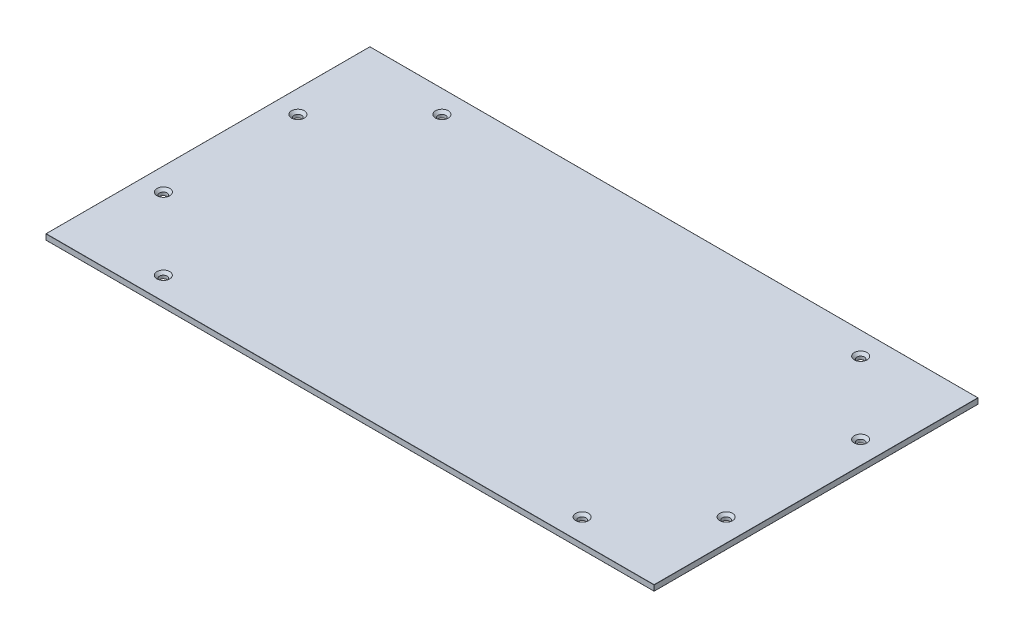
ISO-10303-21;
HEADER;
FILE_DESCRIPTION(('STEP AP214'),'2;1');
FILE_NAME('part.step','',(''),(''),'','','');
FILE_SCHEMA(('AUTOMOTIVE_DESIGN { 1 0 10303 214 1 1 1 1 }'));
ENDSEC;
DATA;
#1=APPLICATION_CONTEXT('core data for automotive mechanical design processes');
#2=APPLICATION_PROTOCOL_DEFINITION('international standard','automotive_design',2000,#1);
#3=PRODUCT_CONTEXT('',#1,'mechanical');
#4=PRODUCT('Part','Part','',(#3));
#5=PRODUCT_RELATED_PRODUCT_CATEGORY('part','',(#4));
#6=PRODUCT_DEFINITION_FORMATION('','',#4);
#7=PRODUCT_DEFINITION_CONTEXT('part definition',#1,'design');
#8=PRODUCT_DEFINITION('design','',#6,#7);
#9=PRODUCT_DEFINITION_SHAPE('','',#8);
#10=(LENGTH_UNIT() NAMED_UNIT(*) SI_UNIT(.MILLI.,.METRE.));
#11=(NAMED_UNIT(*) PLANE_ANGLE_UNIT() SI_UNIT($,.RADIAN.));
#12=(NAMED_UNIT(*) SI_UNIT($,.STERADIAN.) SOLID_ANGLE_UNIT());
#13=UNCERTAINTY_MEASURE_WITH_UNIT(LENGTH_MEASURE(1.E-05),#10,'distance_accuracy_value','');
#14=(GEOMETRIC_REPRESENTATION_CONTEXT(3) GLOBAL_UNCERTAINTY_ASSIGNED_CONTEXT((#13)) GLOBAL_UNIT_ASSIGNED_CONTEXT((#10,
#11,#12)) REPRESENTATION_CONTEXT('',''));
#15=CARTESIAN_POINT('',(0.,0.,0.));
#16=DIRECTION('',(0.,0.,1.));
#17=DIRECTION('',(1.,0.,0.));
#18=AXIS2_PLACEMENT_3D('',#15,#16,#17);
#19=CARTESIAN_POINT('',(321.,6.,-171.));
#20=DIRECTION('',(-1.,0.,0.));
#21=DIRECTION('',(0.,0.,1.));
#22=AXIS2_PLACEMENT_3D('',#19,#20,#21);
#23=PLANE('',#22);
#24=DIRECTION('',(0.,0.,-1.));
#25=VECTOR('',#24,1.);
#26=CARTESIAN_POINT('',(321.,0.2,-171.));
#27=LINE('',#26,#25);
#28=CARTESIAN_POINT('',(321.,0.2,170.8));
#29=VERTEX_POINT('',#28);
#30=CARTESIAN_POINT('',(321.,0.2,-170.8));
#31=VERTEX_POINT('',#30);
#32=EDGE_CURVE('E285',#29,#31,#27,.T.);
#33=ORIENTED_EDGE('',*,*,#32,.T.);
#34=DIRECTION('',(0.,-1.,0.));
#35=VECTOR('',#34,1.);
#36=CARTESIAN_POINT('',(321.,6.,-170.8));
#37=LINE('',#36,#35);
#38=CARTESIAN_POINT('',(321.,5.8,-170.8));
#39=VERTEX_POINT('',#38);
#40=EDGE_CURVE('E287',#31,#39,#37,.F.);
#41=ORIENTED_EDGE('',*,*,#40,.T.);
#42=DIRECTION('',(0.,0.,-1.));
#43=VECTOR('',#42,1.);
#44=CARTESIAN_POINT('',(321.,5.8,171.));
#45=LINE('',#44,#43);
#46=CARTESIAN_POINT('',(321.,5.8,170.8));
#47=VERTEX_POINT('',#46);
#48=EDGE_CURVE('E283',#39,#47,#45,.F.);
#49=ORIENTED_EDGE('',*,*,#48,.T.);
#50=DIRECTION('',(0.,-1.,0.));
#51=VECTOR('',#50,1.);
#52=CARTESIAN_POINT('',(321.,6.,170.8));
#53=LINE('',#52,#51);
#54=EDGE_CURVE('E281',#47,#29,#53,.T.);
#55=ORIENTED_EDGE('',*,*,#54,.T.);
#56=EDGE_LOOP('',(#33,#41,#49,#55));
#57=FACE_BOUND('',#56,.T.);
#58=ADVANCED_FACE('F32',(#57),#23,.F.);
#59=CARTESIAN_POINT('',(-321.,6.,-171.));
#60=DIRECTION('',(0.,0.,1.));
#61=DIRECTION('',(1.,0.,0.));
#62=AXIS2_PLACEMENT_3D('',#59,#60,#61);
#63=PLANE('',#62);
#64=DIRECTION('',(-1.,0.,0.));
#65=VECTOR('',#64,1.);
#66=CARTESIAN_POINT('',(321.,5.8,-171.));
#67=LINE('',#66,#65);
#68=CARTESIAN_POINT('',(-320.8,5.8,-171.));
#69=VERTEX_POINT('',#68);
#70=CARTESIAN_POINT('',(320.8,5.8,-171.));
#71=VERTEX_POINT('',#70);
#72=EDGE_CURVE('E131',#69,#71,#67,.F.);
#73=ORIENTED_EDGE('',*,*,#72,.T.);
#74=DIRECTION('',(0.,-1.,0.));
#75=VECTOR('',#74,1.);
#76=CARTESIAN_POINT('',(320.8,6.,-171.));
#77=LINE('',#76,#75);
#78=CARTESIAN_POINT('',(320.8,0.2,-171.));
#79=VERTEX_POINT('',#78);
#80=EDGE_CURVE('E127',#71,#79,#77,.T.);
#81=ORIENTED_EDGE('',*,*,#80,.T.);
#82=DIRECTION('',(-1.,0.,0.));
#83=VECTOR('',#82,1.);
#84=CARTESIAN_POINT('',(-321.,0.2,-171.));
#85=LINE('',#84,#83);
#86=CARTESIAN_POINT('',(-320.8,0.2,-171.));
#87=VERTEX_POINT('',#86);
#88=EDGE_CURVE('E121',#79,#87,#85,.T.);
#89=ORIENTED_EDGE('',*,*,#88,.T.);
#90=DIRECTION('',(0.,-1.,0.));
#91=VECTOR('',#90,1.);
#92=CARTESIAN_POINT('',(-320.8,6.,-171.));
#93=LINE('',#92,#91);
#94=EDGE_CURVE('E124',#87,#69,#93,.F.);
#95=ORIENTED_EDGE('',*,*,#94,.T.);
#96=EDGE_LOOP('',(#73,#81,#89,#95));
#97=FACE_BOUND('',#96,.T.);
#98=ADVANCED_FACE('F123',(#97),#63,.F.);
#99=CARTESIAN_POINT('',(-321.,6.,-171.));
#100=DIRECTION('',(1.,0.,0.));
#101=DIRECTION('',(0.,0.,-1.));
#102=AXIS2_PLACEMENT_3D('',#99,#100,#101);
#103=PLANE('',#102);
#104=DIRECTION('',(0.,0.,1.));
#105=VECTOR('',#104,1.);
#106=CARTESIAN_POINT('',(-321.,5.8,-171.));
#107=LINE('',#106,#105);
#108=CARTESIAN_POINT('',(-321.,5.8,170.8));
#109=VERTEX_POINT('',#108);
#110=CARTESIAN_POINT('',(-321.,5.8,-170.8));
#111=VERTEX_POINT('',#110);
#112=EDGE_CURVE('E308',#109,#111,#107,.F.);
#113=ORIENTED_EDGE('',*,*,#112,.T.);
#114=DIRECTION('',(0.,-1.,0.));
#115=VECTOR('',#114,1.);
#116=CARTESIAN_POINT('',(-321.,6.,-170.8));
#117=LINE('',#116,#115);
#118=CARTESIAN_POINT('',(-321.,0.2,-170.8));
#119=VERTEX_POINT('',#118);
#120=EDGE_CURVE('E312',#111,#119,#117,.T.);
#121=ORIENTED_EDGE('',*,*,#120,.T.);
#122=DIRECTION('',(0.,0.,1.));
#123=VECTOR('',#122,1.);
#124=CARTESIAN_POINT('',(-321.,0.2,-171.));
#125=LINE('',#124,#123);
#126=CARTESIAN_POINT('',(-321.,0.2,170.8));
#127=VERTEX_POINT('',#126);
#128=EDGE_CURVE('E310',#119,#127,#125,.T.);
#129=ORIENTED_EDGE('',*,*,#128,.T.);
#130=DIRECTION('',(0.,-1.,0.));
#131=VECTOR('',#130,1.);
#132=CARTESIAN_POINT('',(-321.,6.,170.8));
#133=LINE('',#132,#131);
#134=EDGE_CURVE('E306',#127,#109,#133,.F.);
#135=ORIENTED_EDGE('',*,*,#134,.T.);
#136=EDGE_LOOP('',(#113,#121,#129,#135));
#137=FACE_BOUND('',#136,.T.);
#138=ADVANCED_FACE('F363',(#137),#103,.F.);
#139=CARTESIAN_POINT('',(-321.,6.,171.));
#140=DIRECTION('',(0.,0.,-1.));
#141=DIRECTION('',(-1.,0.,0.));
#142=AXIS2_PLACEMENT_3D('',#139,#140,#141);
#143=PLANE('',#142);
#144=DIRECTION('',(0.,-1.,0.));
#145=VECTOR('',#144,1.);
#146=CARTESIAN_POINT('',(-320.8,6.,171.));
#147=LINE('',#146,#145);
#148=CARTESIAN_POINT('',(-320.8,5.8,171.));
#149=VERTEX_POINT('',#148);
#150=CARTESIAN_POINT('',(-320.8,0.2,171.));
#151=VERTEX_POINT('',#150);
#152=EDGE_CURVE('E52',#149,#151,#147,.T.);
#153=ORIENTED_EDGE('',*,*,#152,.T.);
#154=DIRECTION('',(1.,0.,0.));
#155=VECTOR('',#154,1.);
#156=CARTESIAN_POINT('',(-321.,0.2,171.));
#157=LINE('',#156,#155);
#158=CARTESIAN_POINT('',(320.8,0.2,171.));
#159=VERTEX_POINT('',#158);
#160=EDGE_CURVE('E11',#151,#159,#157,.T.);
#161=ORIENTED_EDGE('',*,*,#160,.T.);
#162=DIRECTION('',(0.,-1.,0.));
#163=VECTOR('',#162,1.);
#164=CARTESIAN_POINT('',(320.8,6.,171.));
#165=LINE('',#164,#163);
#166=CARTESIAN_POINT('',(320.8,5.8,171.));
#167=VERTEX_POINT('',#166);
#168=EDGE_CURVE('E41',#159,#167,#165,.F.);
#169=ORIENTED_EDGE('',*,*,#168,.T.);
#170=DIRECTION('',(1.,0.,0.));
#171=VECTOR('',#170,1.);
#172=CARTESIAN_POINT('',(-321.,5.8,171.));
#173=LINE('',#172,#171);
#174=EDGE_CURVE('E315',#167,#149,#173,.F.);
#175=ORIENTED_EDGE('',*,*,#174,.T.);
#176=EDGE_LOOP('',(#153,#161,#169,#175));
#177=FACE_BOUND('',#176,.T.);
#178=ADVANCED_FACE('F717',(#177),#143,.F.);
#179=CARTESIAN_POINT('',(0.,6.,0.));
#180=DIRECTION('',(0.,1.,0.));
#181=DIRECTION('',(0.,0.,1.));
#182=AXIS2_PLACEMENT_3D('',#179,#180,#181);
#183=PLANE('',#182);
#184=DIRECTION('',(0.,0.,-1.));
#185=VECTOR('',#184,1.);
#186=CARTESIAN_POINT('',(320.8,6.,-171.));
#187=LINE('',#186,#185);
#188=CARTESIAN_POINT('',(320.8,6.,170.8));
#189=VERTEX_POINT('',#188);
#190=CARTESIAN_POINT('',(320.8,6.,-170.8));
#191=VERTEX_POINT('',#190);
#192=EDGE_CURVE('E301',#189,#191,#187,.T.);
#193=ORIENTED_EDGE('',*,*,#192,.T.);
#194=DIRECTION('',(-1.,0.,0.));
#195=VECTOR('',#194,1.);
#196=CARTESIAN_POINT('',(-321.,6.,-170.8));
#197=LINE('',#196,#195);
#198=CARTESIAN_POINT('',(-320.8,6.,-170.8));
#199=VERTEX_POINT('',#198);
#200=EDGE_CURVE('E303',#191,#199,#197,.T.);
#201=ORIENTED_EDGE('',*,*,#200,.T.);
#202=DIRECTION('',(0.,0.,1.));
#203=VECTOR('',#202,1.);
#204=CARTESIAN_POINT('',(-320.8,6.,171.));
#205=LINE('',#204,#203);
#206=CARTESIAN_POINT('',(-320.8,6.,170.8));
#207=VERTEX_POINT('',#206);
#208=EDGE_CURVE('E299',#199,#207,#205,.T.);
#209=ORIENTED_EDGE('',*,*,#208,.T.);
#210=DIRECTION('',(1.,0.,0.));
#211=VECTOR('',#210,1.);
#212=CARTESIAN_POINT('',(321.,6.,170.8));
#213=LINE('',#212,#211);
#214=EDGE_CURVE('E297',#207,#189,#213,.T.);
#215=ORIENTED_EDGE('',*,*,#214,.T.);
#216=EDGE_LOOP('',(#193,#201,#209,#215));
#217=FACE_BOUND('',#216,.T.);
#218=CARTESIAN_POINT('',(-297.,6.,-71.));
#219=DIRECTION('',(0.,1.,0.));
#220=DIRECTION('',(0.,0.,1.));
#221=AXIS2_PLACEMENT_3D('',#218,#219,#220);
#222=CIRCLE('',#221,6.75000000000003);
#223=CARTESIAN_POINT('',(-297.,6.,-64.2499999999999));
#224=VERTEX_POINT('',#223);
#225=EDGE_CURVE('E256',#224,#224,#222,.F.);
#226=ORIENTED_EDGE('',*,*,#225,.T.);
#227=EDGE_LOOP('',(#226));
#228=FACE_BOUND('',#227,.T.);
#229=CARTESIAN_POINT('',(-221.,6.,-147.));
#230=DIRECTION('',(0.,1.,0.));
#231=DIRECTION('',(0.,0.,1.));
#232=AXIS2_PLACEMENT_3D('',#229,#230,#231);
#233=CIRCLE('',#232,6.75000000000003);
#234=CARTESIAN_POINT('',(-221.,6.,-140.25));
#235=VERTEX_POINT('',#234);
#236=EDGE_CURVE('E253',#235,#235,#233,.F.);
#237=ORIENTED_EDGE('',*,*,#236,.T.);
#238=EDGE_LOOP('',(#237));
#239=FACE_BOUND('',#238,.T.);
#240=CARTESIAN_POINT('',(221.,6.,-147.));
#241=DIRECTION('',(0.,1.,0.));
#242=DIRECTION('',(0.,0.,1.));
#243=AXIS2_PLACEMENT_3D('',#240,#241,#242);
#244=CIRCLE('',#243,6.75000000000003);
#245=CARTESIAN_POINT('',(221.,6.,-140.25));
#246=VERTEX_POINT('',#245);
#247=EDGE_CURVE('E250',#246,#246,#244,.F.);
#248=ORIENTED_EDGE('',*,*,#247,.T.);
#249=EDGE_LOOP('',(#248));
#250=FACE_BOUND('',#249,.T.);
#251=CARTESIAN_POINT('',(297.,6.,-71.));
#252=DIRECTION('',(0.,1.,0.));
#253=DIRECTION('',(0.,0.,1.));
#254=AXIS2_PLACEMENT_3D('',#251,#252,#253);
#255=CIRCLE('',#254,6.75000000000003);
#256=CARTESIAN_POINT('',(297.,6.,-64.25));
#257=VERTEX_POINT('',#256);
#258=EDGE_CURVE('E247',#257,#257,#255,.F.);
#259=ORIENTED_EDGE('',*,*,#258,.T.);
#260=EDGE_LOOP('',(#259));
#261=FACE_BOUND('',#260,.T.);
#262=CARTESIAN_POINT('',(297.,6.,70.9999999999999));
#263=DIRECTION('',(0.,1.,0.));
#264=DIRECTION('',(0.,0.,1.));
#265=AXIS2_PLACEMENT_3D('',#262,#263,#264);
#266=CIRCLE('',#265,6.75000000000003);
#267=CARTESIAN_POINT('',(297.,6.,77.7499999999999));
#268=VERTEX_POINT('',#267);
#269=EDGE_CURVE('E244',#268,#268,#266,.F.);
#270=ORIENTED_EDGE('',*,*,#269,.T.);
#271=EDGE_LOOP('',(#270));
#272=FACE_BOUND('',#271,.T.);
#273=CARTESIAN_POINT('',(221.,6.,147.));
#274=DIRECTION('',(0.,1.,0.));
#275=DIRECTION('',(0.,0.,1.));
#276=AXIS2_PLACEMENT_3D('',#273,#274,#275);
#277=CIRCLE('',#276,6.75000000000003);
#278=CARTESIAN_POINT('',(221.,6.,153.75));
#279=VERTEX_POINT('',#278);
#280=EDGE_CURVE('E241',#279,#279,#277,.F.);
#281=ORIENTED_EDGE('',*,*,#280,.T.);
#282=EDGE_LOOP('',(#281));
#283=FACE_BOUND('',#282,.T.);
#284=CARTESIAN_POINT('',(-221.,6.,147.));
#285=DIRECTION('',(0.,1.,0.));
#286=DIRECTION('',(0.,0.,1.));
#287=AXIS2_PLACEMENT_3D('',#284,#285,#286);
#288=CIRCLE('',#287,6.75000000000003);
#289=CARTESIAN_POINT('',(-221.,6.,153.75));
#290=VERTEX_POINT('',#289);
#291=EDGE_CURVE('E238',#290,#290,#288,.F.);
#292=ORIENTED_EDGE('',*,*,#291,.T.);
#293=EDGE_LOOP('',(#292));
#294=FACE_BOUND('',#293,.T.);
#295=CARTESIAN_POINT('',(-297.,6.,71.));
#296=DIRECTION('',(0.,1.,0.));
#297=DIRECTION('',(0.,0.,1.));
#298=AXIS2_PLACEMENT_3D('',#295,#296,#297);
#299=CIRCLE('',#298,6.75000000000003);
#300=CARTESIAN_POINT('',(-297.,6.,77.75));
#301=VERTEX_POINT('',#300);
#302=EDGE_CURVE('E235',#301,#301,#299,.F.);
#303=ORIENTED_EDGE('',*,*,#302,.T.);
#304=EDGE_LOOP('',(#303));
#305=FACE_BOUND('',#304,.T.);
#306=ADVANCED_FACE('F376',(#217,#228,#239,#250,#261,#272,#283,#294,#305),#183,.T.);
#307=CARTESIAN_POINT('',(0.,0.,0.));
#308=DIRECTION('',(0.,1.,0.));
#309=DIRECTION('',(0.,0.,1.));
#310=AXIS2_PLACEMENT_3D('',#307,#308,#309);
#311=PLANE('',#310);
#312=DIRECTION('',(0.,0.,1.));
#313=VECTOR('',#312,1.);
#314=CARTESIAN_POINT('',(-320.8,0.,0.));
#315=LINE('',#314,#313);
#316=CARTESIAN_POINT('',(-320.8,0.,170.8));
#317=VERTEX_POINT('',#316);
#318=CARTESIAN_POINT('',(-320.8,0.,-170.8));
#319=VERTEX_POINT('',#318);
#320=EDGE_CURVE('E292',#317,#319,#315,.F.);
#321=ORIENTED_EDGE('',*,*,#320,.T.);
#322=DIRECTION('',(-1.,0.,0.));
#323=VECTOR('',#322,1.);
#324=CARTESIAN_POINT('',(0.,0.,-170.8));
#325=LINE('',#324,#323);
#326=CARTESIAN_POINT('',(320.8,0.,-170.8));
#327=VERTEX_POINT('',#326);
#328=EDGE_CURVE('E155',#319,#327,#325,.F.);
#329=ORIENTED_EDGE('',*,*,#328,.T.);
#330=DIRECTION('',(0.,0.,-1.));
#331=VECTOR('',#330,1.);
#332=CARTESIAN_POINT('',(320.8,0.,0.));
#333=LINE('',#332,#331);
#334=CARTESIAN_POINT('',(320.8,0.,170.8));
#335=VERTEX_POINT('',#334);
#336=EDGE_CURVE('E294',#327,#335,#333,.F.);
#337=ORIENTED_EDGE('',*,*,#336,.T.);
#338=DIRECTION('',(1.,0.,0.));
#339=VECTOR('',#338,1.);
#340=CARTESIAN_POINT('',(0.,0.,170.8));
#341=LINE('',#340,#339);
#342=EDGE_CURVE('E290',#335,#317,#341,.F.);
#343=ORIENTED_EDGE('',*,*,#342,.T.);
#344=EDGE_LOOP('',(#321,#329,#337,#343));
#345=FACE_BOUND('',#344,.T.);
#346=CARTESIAN_POINT('',(-297.,0.,-71.));
#347=DIRECTION('',(0.,1.,0.));
#348=DIRECTION('',(0.,0.,-1.));
#349=AXIS2_PLACEMENT_3D('',#346,#347,#348);
#350=CIRCLE('',#349,3.99999999999999);
#351=CARTESIAN_POINT('',(-297.,0.,-74.9999999999999));
#352=VERTEX_POINT('',#351);
#353=EDGE_CURVE('E201',#352,#352,#350,.T.);
#354=ORIENTED_EDGE('',*,*,#353,.T.);
#355=EDGE_LOOP('',(#354));
#356=FACE_BOUND('',#355,.T.);
#357=CARTESIAN_POINT('',(-221.,0.,-147.));
#358=DIRECTION('',(0.,1.,0.));
#359=DIRECTION('',(0.,0.,-1.));
#360=AXIS2_PLACEMENT_3D('',#357,#358,#359);
#361=CIRCLE('',#360,3.99999999999999);
#362=CARTESIAN_POINT('',(-221.,0.,-151.));
#363=VERTEX_POINT('',#362);
#364=EDGE_CURVE('E207',#363,#363,#361,.T.);
#365=ORIENTED_EDGE('',*,*,#364,.T.);
#366=EDGE_LOOP('',(#365));
#367=FACE_BOUND('',#366,.T.);
#368=CARTESIAN_POINT('',(221.,0.,-147.));
#369=DIRECTION('',(0.,1.,0.));
#370=DIRECTION('',(0.,0.,1.));
#371=AXIS2_PLACEMENT_3D('',#368,#369,#370);
#372=CIRCLE('',#371,3.99999999999999);
#373=CARTESIAN_POINT('',(221.,0.,-143.));
#374=VERTEX_POINT('',#373);
#375=EDGE_CURVE('E212',#374,#374,#372,.T.);
#376=ORIENTED_EDGE('',*,*,#375,.T.);
#377=EDGE_LOOP('',(#376));
#378=FACE_BOUND('',#377,.T.);
#379=CARTESIAN_POINT('',(297.,0.,-71.));
#380=DIRECTION('',(0.,1.,0.));
#381=DIRECTION('',(0.,0.,1.));
#382=AXIS2_PLACEMENT_3D('',#379,#380,#381);
#383=CIRCLE('',#382,3.99999999999999);
#384=CARTESIAN_POINT('',(297.,0.,-67.));
#385=VERTEX_POINT('',#384);
#386=EDGE_CURVE('E217',#385,#385,#383,.T.);
#387=ORIENTED_EDGE('',*,*,#386,.T.);
#388=EDGE_LOOP('',(#387));
#389=FACE_BOUND('',#388,.T.);
#390=CARTESIAN_POINT('',(297.,0.,70.9999999999999));
#391=DIRECTION('',(0.,1.,0.));
#392=DIRECTION('',(0.,0.,-1.));
#393=AXIS2_PLACEMENT_3D('',#390,#391,#392);
#394=CIRCLE('',#393,3.99999999999999);
#395=CARTESIAN_POINT('',(297.,0.,66.9999999999999));
#396=VERTEX_POINT('',#395);
#397=EDGE_CURVE('E220',#396,#396,#394,.T.);
#398=ORIENTED_EDGE('',*,*,#397,.T.);
#399=EDGE_LOOP('',(#398));
#400=FACE_BOUND('',#399,.T.);
#401=CARTESIAN_POINT('',(-297.,0.,71.));
#402=DIRECTION('',(0.,1.,0.));
#403=DIRECTION('',(0.,0.,1.));
#404=AXIS2_PLACEMENT_3D('',#401,#402,#403);
#405=CIRCLE('',#404,3.99999999999999);
#406=CARTESIAN_POINT('',(-297.,0.,74.9999999999999));
#407=VERTEX_POINT('',#406);
#408=EDGE_CURVE('E223',#407,#407,#405,.T.);
#409=ORIENTED_EDGE('',*,*,#408,.T.);
#410=EDGE_LOOP('',(#409));
#411=FACE_BOUND('',#410,.T.);
#412=CARTESIAN_POINT('',(221.,0.,147.));
#413=DIRECTION('',(0.,1.,0.));
#414=DIRECTION('',(0.,0.,-1.));
#415=AXIS2_PLACEMENT_3D('',#412,#413,#414);
#416=CIRCLE('',#415,3.99999999999999);
#417=CARTESIAN_POINT('',(221.,0.,143.));
#418=VERTEX_POINT('',#417);
#419=EDGE_CURVE('E226',#418,#418,#416,.T.);
#420=ORIENTED_EDGE('',*,*,#419,.T.);
#421=EDGE_LOOP('',(#420));
#422=FACE_BOUND('',#421,.T.);
#423=CARTESIAN_POINT('',(-221.,0.,147.));
#424=DIRECTION('',(0.,1.,0.));
#425=DIRECTION('',(0.,0.,1.));
#426=AXIS2_PLACEMENT_3D('',#423,#424,#425);
#427=CIRCLE('',#426,3.99999999999999);
#428=CARTESIAN_POINT('',(-221.,0.,151.));
#429=VERTEX_POINT('',#428);
#430=EDGE_CURVE('E229',#429,#429,#427,.T.);
#431=ORIENTED_EDGE('',*,*,#430,.T.);
#432=EDGE_LOOP('',(#431));
#433=FACE_BOUND('',#432,.T.);
#434=ADVANCED_FACE('F357',(#345,#356,#367,#378,#389,#400,#411,#422,#433),#311,.F.);
#435=CARTESIAN_POINT('',(-221.,0.,147.));
#436=DIRECTION('',(0.,1.,0.));
#437=DIRECTION('',(0.,0.,1.));
#438=AXIS2_PLACEMENT_3D('',#435,#436,#437);
#439=CYLINDRICAL_SURFACE('',#438,3.99999999999999);
#440=CARTESIAN_POINT('',(-221.,3.24999999999995,147.));
#441=DIRECTION('',(0.,1.,0.));
#442=DIRECTION('',(0.,0.,1.));
#443=AXIS2_PLACEMENT_3D('',#440,#441,#442);
#444=CIRCLE('',#443,3.99999999999999);
#445=CARTESIAN_POINT('',(-221.,3.24999999999995,151.));
#446=VERTEX_POINT('',#445);
#447=EDGE_CURVE('E274',#446,#446,#444,.T.);
#448=ORIENTED_EDGE('',*,*,#447,.T.);
#449=EDGE_LOOP('',(#448));
#450=FACE_BOUND('',#449,.T.);
#451=ORIENTED_EDGE('',*,*,#430,.F.);
#452=EDGE_LOOP('',(#451));
#453=FACE_BOUND('',#452,.T.);
#454=ADVANCED_FACE('F694',(#450,#453),#439,.F.);
#455=CARTESIAN_POINT('',(221.,0.,147.));
#456=DIRECTION('',(0.,1.,0.));
#457=DIRECTION('',(0.,0.,1.));
#458=AXIS2_PLACEMENT_3D('',#455,#456,#457);
#459=CYLINDRICAL_SURFACE('',#458,3.99999999999999);
#460=CARTESIAN_POINT('',(221.,3.24999999999995,147.));
#461=DIRECTION('',(0.,1.,0.));
#462=DIRECTION('',(0.,0.,1.));
#463=AXIS2_PLACEMENT_3D('',#460,#461,#462);
#464=CIRCLE('',#463,3.99999999999999);
#465=CARTESIAN_POINT('',(221.,3.24999999999995,151.));
#466=VERTEX_POINT('',#465);
#467=EDGE_CURVE('E271',#466,#466,#464,.T.);
#468=ORIENTED_EDGE('',*,*,#467,.T.);
#469=EDGE_LOOP('',(#468));
#470=FACE_BOUND('',#469,.T.);
#471=ORIENTED_EDGE('',*,*,#419,.F.);
#472=EDGE_LOOP('',(#471));
#473=FACE_BOUND('',#472,.T.);
#474=ADVANCED_FACE('F685',(#470,#473),#459,.F.);
#475=CARTESIAN_POINT('',(-297.,0.,71.));
#476=DIRECTION('',(0.,1.,0.));
#477=DIRECTION('',(0.,0.,1.));
#478=AXIS2_PLACEMENT_3D('',#475,#476,#477);
#479=CYLINDRICAL_SURFACE('',#478,3.99999999999999);
#480=CARTESIAN_POINT('',(-297.,3.24999999999995,71.));
#481=DIRECTION('',(0.,1.,0.));
#482=DIRECTION('',(0.,0.,1.));
#483=AXIS2_PLACEMENT_3D('',#480,#481,#482);
#484=CIRCLE('',#483,3.99999999999999);
#485=CARTESIAN_POINT('',(-297.,3.24999999999995,74.9999999999999));
#486=VERTEX_POINT('',#485);
#487=EDGE_CURVE('E143',#486,#486,#484,.T.);
#488=ORIENTED_EDGE('',*,*,#487,.T.);
#489=EDGE_LOOP('',(#488));
#490=FACE_BOUND('',#489,.T.);
#491=ORIENTED_EDGE('',*,*,#408,.F.);
#492=EDGE_LOOP('',(#491));
#493=FACE_BOUND('',#492,.T.);
#494=ADVANCED_FACE('F676',(#490,#493),#479,.F.);
#495=CARTESIAN_POINT('',(297.,0.,70.9999999999999));
#496=DIRECTION('',(0.,1.,0.));
#497=DIRECTION('',(0.,0.,1.));
#498=AXIS2_PLACEMENT_3D('',#495,#496,#497);
#499=CYLINDRICAL_SURFACE('',#498,3.99999999999999);
#500=CARTESIAN_POINT('',(297.,3.24999999999995,70.9999999999999));
#501=DIRECTION('',(0.,1.,0.));
#502=DIRECTION('',(0.,0.,1.));
#503=AXIS2_PLACEMENT_3D('',#500,#501,#502);
#504=CIRCLE('',#503,3.99999999999999);
#505=CARTESIAN_POINT('',(297.,3.24999999999995,74.9999999999999));
#506=VERTEX_POINT('',#505);
#507=EDGE_CURVE('E268',#506,#506,#504,.T.);
#508=ORIENTED_EDGE('',*,*,#507,.T.);
#509=EDGE_LOOP('',(#508));
#510=FACE_BOUND('',#509,.T.);
#511=ORIENTED_EDGE('',*,*,#397,.F.);
#512=EDGE_LOOP('',(#511));
#513=FACE_BOUND('',#512,.T.);
#514=ADVANCED_FACE('F667',(#510,#513),#499,.F.);
#515=CARTESIAN_POINT('',(297.,0.,-71.));
#516=DIRECTION('',(0.,1.,0.));
#517=DIRECTION('',(0.,0.,1.));
#518=AXIS2_PLACEMENT_3D('',#515,#516,#517);
#519=CYLINDRICAL_SURFACE('',#518,3.99999999999999);
#520=CARTESIAN_POINT('',(297.,3.24999999999995,-71.));
#521=DIRECTION('',(0.,1.,0.));
#522=DIRECTION('',(0.,0.,1.));
#523=AXIS2_PLACEMENT_3D('',#520,#521,#522);
#524=CIRCLE('',#523,3.99999999999999);
#525=CARTESIAN_POINT('',(297.,3.24999999999995,-67.));
#526=VERTEX_POINT('',#525);
#527=EDGE_CURVE('E265',#526,#526,#524,.T.);
#528=ORIENTED_EDGE('',*,*,#527,.T.);
#529=EDGE_LOOP('',(#528));
#530=FACE_BOUND('',#529,.T.);
#531=ORIENTED_EDGE('',*,*,#386,.F.);
#532=EDGE_LOOP('',(#531));
#533=FACE_BOUND('',#532,.T.);
#534=ADVANCED_FACE('F658',(#530,#533),#519,.F.);
#535=CARTESIAN_POINT('',(221.,0.,-147.));
#536=DIRECTION('',(0.,1.,0.));
#537=DIRECTION('',(0.,0.,1.));
#538=AXIS2_PLACEMENT_3D('',#535,#536,#537);
#539=CYLINDRICAL_SURFACE('',#538,3.99999999999999);
#540=CARTESIAN_POINT('',(221.,3.24999999999995,-147.));
#541=DIRECTION('',(0.,1.,0.));
#542=DIRECTION('',(0.,0.,1.));
#543=AXIS2_PLACEMENT_3D('',#540,#541,#542);
#544=CIRCLE('',#543,3.99999999999999);
#545=CARTESIAN_POINT('',(221.,3.24999999999995,-143.));
#546=VERTEX_POINT('',#545);
#547=EDGE_CURVE('E262',#546,#546,#544,.T.);
#548=ORIENTED_EDGE('',*,*,#547,.T.);
#549=EDGE_LOOP('',(#548));
#550=FACE_BOUND('',#549,.T.);
#551=ORIENTED_EDGE('',*,*,#375,.F.);
#552=EDGE_LOOP('',(#551));
#553=FACE_BOUND('',#552,.T.);
#554=ADVANCED_FACE('F649',(#550,#553),#539,.F.);
#555=CARTESIAN_POINT('',(-221.,0.,-147.));
#556=DIRECTION('',(0.,1.,0.));
#557=DIRECTION('',(0.,0.,1.));
#558=AXIS2_PLACEMENT_3D('',#555,#556,#557);
#559=CYLINDRICAL_SURFACE('',#558,3.99999999999999);
#560=CARTESIAN_POINT('',(-221.,3.24999999999995,-147.));
#561=DIRECTION('',(0.,1.,0.));
#562=DIRECTION('',(0.,0.,1.));
#563=AXIS2_PLACEMENT_3D('',#560,#561,#562);
#564=CIRCLE('',#563,3.99999999999999);
#565=CARTESIAN_POINT('',(-221.,3.24999999999995,-143.));
#566=VERTEX_POINT('',#565);
#567=EDGE_CURVE('E259',#566,#566,#564,.T.);
#568=ORIENTED_EDGE('',*,*,#567,.T.);
#569=EDGE_LOOP('',(#568));
#570=FACE_BOUND('',#569,.T.);
#571=ORIENTED_EDGE('',*,*,#364,.F.);
#572=EDGE_LOOP('',(#571));
#573=FACE_BOUND('',#572,.T.);
#574=ADVANCED_FACE('F640',(#570,#573),#559,.F.);
#575=CARTESIAN_POINT('',(-297.,0.,-71.));
#576=DIRECTION('',(0.,1.,0.));
#577=DIRECTION('',(0.,0.,1.));
#578=AXIS2_PLACEMENT_3D('',#575,#576,#577);
#579=CYLINDRICAL_SURFACE('',#578,3.99999999999999);
#580=CARTESIAN_POINT('',(-297.,3.24999999999995,-71.));
#581=DIRECTION('',(0.,1.,0.));
#582=DIRECTION('',(0.,0.,1.));
#583=AXIS2_PLACEMENT_3D('',#580,#581,#582);
#584=CIRCLE('',#583,3.99999999999999);
#585=CARTESIAN_POINT('',(-297.,3.24999999999995,-67.));
#586=VERTEX_POINT('',#585);
#587=EDGE_CURVE('E232',#586,#586,#584,.T.);
#588=ORIENTED_EDGE('',*,*,#587,.T.);
#589=EDGE_LOOP('',(#588));
#590=FACE_BOUND('',#589,.T.);
#591=ORIENTED_EDGE('',*,*,#353,.F.);
#592=EDGE_LOOP('',(#591));
#593=FACE_BOUND('',#592,.T.);
#594=ADVANCED_FACE('F415',(#590,#593),#579,.F.);
#595=CARTESIAN_POINT('',(-297.,3.24999999999995,-71.));
#596=DIRECTION('',(0.,1.,0.));
#597=DIRECTION('',(0.,0.,1.));
#598=AXIS2_PLACEMENT_3D('',#595,#596,#597);
#599=CONICAL_SURFACE('',#598,3.99999999999999,0.785398163397446);
#600=ORIENTED_EDGE('',*,*,#225,.F.);
#601=EDGE_LOOP('',(#600));
#602=FACE_BOUND('',#601,.T.);
#603=ORIENTED_EDGE('',*,*,#587,.F.);
#604=EDGE_LOOP('',(#603));
#605=FACE_BOUND('',#604,.T.);
#606=ADVANCED_FACE('F411',(#602,#605),#599,.F.);
#607=CARTESIAN_POINT('',(-221.,3.24999999999995,-147.));
#608=DIRECTION('',(0.,1.,0.));
#609=DIRECTION('',(0.,0.,1.));
#610=AXIS2_PLACEMENT_3D('',#607,#608,#609);
#611=CONICAL_SURFACE('',#610,3.99999999999999,0.785398163397446);
#612=ORIENTED_EDGE('',*,*,#236,.F.);
#613=EDGE_LOOP('',(#612));
#614=FACE_BOUND('',#613,.T.);
#615=ORIENTED_EDGE('',*,*,#567,.F.);
#616=EDGE_LOOP('',(#615));
#617=FACE_BOUND('',#616,.T.);
#618=ADVANCED_FACE('F414',(#614,#617),#611,.F.);
#619=CARTESIAN_POINT('',(221.,3.24999999999995,-147.));
#620=DIRECTION('',(0.,1.,0.));
#621=DIRECTION('',(0.,0.,1.));
#622=AXIS2_PLACEMENT_3D('',#619,#620,#621);
#623=CONICAL_SURFACE('',#622,3.99999999999999,0.785398163397446);
#624=ORIENTED_EDGE('',*,*,#247,.F.);
#625=EDGE_LOOP('',(#624));
#626=FACE_BOUND('',#625,.T.);
#627=ORIENTED_EDGE('',*,*,#547,.F.);
#628=EDGE_LOOP('',(#627));
#629=FACE_BOUND('',#628,.T.);
#630=ADVANCED_FACE('F419',(#626,#629),#623,.F.);
#631=CARTESIAN_POINT('',(297.,3.24999999999995,-71.));
#632=DIRECTION('',(0.,1.,0.));
#633=DIRECTION('',(0.,0.,1.));
#634=AXIS2_PLACEMENT_3D('',#631,#632,#633);
#635=CONICAL_SURFACE('',#634,3.99999999999999,0.785398163397446);
#636=ORIENTED_EDGE('',*,*,#258,.F.);
#637=EDGE_LOOP('',(#636));
#638=FACE_BOUND('',#637,.T.);
#639=ORIENTED_EDGE('',*,*,#527,.F.);
#640=EDGE_LOOP('',(#639));
#641=FACE_BOUND('',#640,.T.);
#642=ADVANCED_FACE('F423',(#638,#641),#635,.F.);
#643=CARTESIAN_POINT('',(297.,3.24999999999995,70.9999999999999));
#644=DIRECTION('',(0.,1.,0.));
#645=DIRECTION('',(0.,0.,1.));
#646=AXIS2_PLACEMENT_3D('',#643,#644,#645);
#647=CONICAL_SURFACE('',#646,3.99999999999999,0.785398163397446);
#648=ORIENTED_EDGE('',*,*,#269,.F.);
#649=EDGE_LOOP('',(#648));
#650=FACE_BOUND('',#649,.T.);
#651=ORIENTED_EDGE('',*,*,#507,.F.);
#652=EDGE_LOOP('',(#651));
#653=FACE_BOUND('',#652,.T.);
#654=ADVANCED_FACE('F427',(#650,#653),#647,.F.);
#655=CARTESIAN_POINT('',(221.,3.24999999999995,147.));
#656=DIRECTION('',(0.,1.,0.));
#657=DIRECTION('',(0.,0.,1.));
#658=AXIS2_PLACEMENT_3D('',#655,#656,#657);
#659=CONICAL_SURFACE('',#658,3.99999999999999,0.785398163397446);
#660=ORIENTED_EDGE('',*,*,#280,.F.);
#661=EDGE_LOOP('',(#660));
#662=FACE_BOUND('',#661,.T.);
#663=ORIENTED_EDGE('',*,*,#467,.F.);
#664=EDGE_LOOP('',(#663));
#665=FACE_BOUND('',#664,.T.);
#666=ADVANCED_FACE('F431',(#662,#665),#659,.F.);
#667=CARTESIAN_POINT('',(-221.,3.24999999999995,147.));
#668=DIRECTION('',(0.,1.,0.));
#669=DIRECTION('',(0.,0.,1.));
#670=AXIS2_PLACEMENT_3D('',#667,#668,#669);
#671=CONICAL_SURFACE('',#670,3.99999999999999,0.785398163397446);
#672=ORIENTED_EDGE('',*,*,#291,.F.);
#673=EDGE_LOOP('',(#672));
#674=FACE_BOUND('',#673,.T.);
#675=ORIENTED_EDGE('',*,*,#447,.F.);
#676=EDGE_LOOP('',(#675));
#677=FACE_BOUND('',#676,.T.);
#678=ADVANCED_FACE('F435',(#674,#677),#671,.F.);
#679=CARTESIAN_POINT('',(-297.,3.24999999999995,71.));
#680=DIRECTION('',(0.,1.,0.));
#681=DIRECTION('',(0.,0.,1.));
#682=AXIS2_PLACEMENT_3D('',#679,#680,#681);
#683=CONICAL_SURFACE('',#682,3.99999999999999,0.785398163397446);
#684=ORIENTED_EDGE('',*,*,#302,.F.);
#685=EDGE_LOOP('',(#684));
#686=FACE_BOUND('',#685,.T.);
#687=ORIENTED_EDGE('',*,*,#487,.F.);
#688=EDGE_LOOP('',(#687));
#689=FACE_BOUND('',#688,.T.);
#690=ADVANCED_FACE('F439',(#686,#689),#683,.F.);
#691=CARTESIAN_POINT('',(-320.8,6.,170.8));
#692=DIRECTION('',(0.,-1.,0.));
#693=DIRECTION('',(0.,0.,-1.));
#694=AXIS2_PLACEMENT_3D('',#691,#692,#693);
#695=CYLINDRICAL_SURFACE('',#694,0.2);
#696=CARTESIAN_POINT('',(-320.8,5.8,170.8));
#697=DIRECTION('',(0.,1.,0.));
#698=DIRECTION('',(0.,0.,1.));
#699=AXIS2_PLACEMENT_3D('',#696,#697,#698);
#700=CIRCLE('',#699,0.2);
#701=EDGE_CURVE('E36',#109,#149,#700,.T.);
#702=ORIENTED_EDGE('',*,*,#701,.F.);
#703=ORIENTED_EDGE('',*,*,#134,.F.);
#704=CARTESIAN_POINT('',(-320.8,0.2,170.8));
#705=DIRECTION('',(0.,-1.,0.));
#706=DIRECTION('',(0.,0.,-1.));
#707=AXIS2_PLACEMENT_3D('',#704,#705,#706);
#708=CIRCLE('',#707,0.2);
#709=EDGE_CURVE('E195',#151,#127,#708,.T.);
#710=ORIENTED_EDGE('',*,*,#709,.F.);
#711=ORIENTED_EDGE('',*,*,#152,.F.);
#712=EDGE_LOOP('',(#702,#703,#710,#711));
#713=FACE_BOUND('',#712,.T.);
#714=ADVANCED_FACE('F34',(#713),#695,.T.);
#715=CARTESIAN_POINT('',(-320.8,5.8,170.8));
#716=DIRECTION('',(0.,0.,1.));
#717=DIRECTION('',(1.,0.,0.));
#718=AXIS2_PLACEMENT_3D('',#715,#716,#717);
#719=SPHERICAL_SURFACE('',#718,0.2);
#720=CARTESIAN_POINT('',(-320.8,5.8,170.8));
#721=DIRECTION('',(0.,0.,1.));
#722=DIRECTION('',(1.,0.,0.));
#723=AXIS2_PLACEMENT_3D('',#720,#721,#722);
#724=CIRCLE('',#723,0.2);
#725=EDGE_CURVE('E190',#109,#207,#724,.F.);
#726=ORIENTED_EDGE('',*,*,#725,.F.);
#727=ORIENTED_EDGE('',*,*,#701,.T.);
#728=CARTESIAN_POINT('',(-320.8,5.8,170.8));
#729=DIRECTION('',(-1.,0.,0.));
#730=DIRECTION('',(0.,0.,1.));
#731=AXIS2_PLACEMENT_3D('',#728,#729,#730);
#732=CIRCLE('',#731,0.2);
#733=EDGE_CURVE('E193',#207,#149,#732,.F.);
#734=ORIENTED_EDGE('',*,*,#733,.F.);
#735=EDGE_LOOP('',(#726,#727,#734));
#736=FACE_BOUND('',#735,.T.);
#737=ADVANCED_FACE('F396',(#736),#719,.T.);
#738=CARTESIAN_POINT('',(-320.8,0.2,170.8));
#739=DIRECTION('',(0.,0.,1.));
#740=DIRECTION('',(1.,0.,0.));
#741=AXIS2_PLACEMENT_3D('',#738,#739,#740);
#742=SPHERICAL_SURFACE('',#741,0.2);
#743=CARTESIAN_POINT('',(-320.8,0.2,170.8));
#744=DIRECTION('',(-1.,0.,0.));
#745=DIRECTION('',(0.,0.,1.));
#746=AXIS2_PLACEMENT_3D('',#743,#744,#745);
#747=CIRCLE('',#746,0.2);
#748=EDGE_CURVE('E184',#151,#317,#747,.F.);
#749=ORIENTED_EDGE('',*,*,#748,.F.);
#750=ORIENTED_EDGE('',*,*,#709,.T.);
#751=CARTESIAN_POINT('',(-320.8,0.2,170.8));
#752=DIRECTION('',(0.,0.,1.));
#753=DIRECTION('',(1.,0.,0.));
#754=AXIS2_PLACEMENT_3D('',#751,#752,#753);
#755=CIRCLE('',#754,0.2);
#756=EDGE_CURVE('E187',#317,#127,#755,.F.);
#757=ORIENTED_EDGE('',*,*,#756,.F.);
#758=EDGE_LOOP('',(#749,#750,#757));
#759=FACE_BOUND('',#758,.T.);
#760=ADVANCED_FACE('F394',(#759),#742,.T.);
#761=CARTESIAN_POINT('',(0.,5.8,170.8));
#762=DIRECTION('',(-1.,0.,0.));
#763=DIRECTION('',(0.,0.,1.));
#764=AXIS2_PLACEMENT_3D('',#761,#762,#763);
#765=CYLINDRICAL_SURFACE('',#764,0.2);
#766=ORIENTED_EDGE('',*,*,#733,.T.);
#767=ORIENTED_EDGE('',*,*,#174,.F.);
#768=CARTESIAN_POINT('',(320.8,5.8,170.8));
#769=DIRECTION('',(1.,0.,0.));
#770=DIRECTION('',(0.,0.,-1.));
#771=AXIS2_PLACEMENT_3D('',#768,#769,#770);
#772=CIRCLE('',#771,0.2);
#773=EDGE_CURVE('E179',#189,#167,#772,.T.);
#774=ORIENTED_EDGE('',*,*,#773,.F.);
#775=ORIENTED_EDGE('',*,*,#214,.F.);
#776=EDGE_LOOP('',(#766,#767,#774,#775));
#777=FACE_BOUND('',#776,.T.);
#778=ADVANCED_FACE('F382',(#777),#765,.T.);
#779=CARTESIAN_POINT('',(-320.8,5.8,0.));
#780=DIRECTION('',(0.,0.,-1.));
#781=DIRECTION('',(-1.,0.,0.));
#782=AXIS2_PLACEMENT_3D('',#779,#780,#781);
#783=CYLINDRICAL_SURFACE('',#782,0.2);
#784=ORIENTED_EDGE('',*,*,#725,.T.);
#785=ORIENTED_EDGE('',*,*,#208,.F.);
#786=CARTESIAN_POINT('',(-320.8,5.8,-170.8));
#787=DIRECTION('',(0.,0.,-1.));
#788=DIRECTION('',(-1.,0.,0.));
#789=AXIS2_PLACEMENT_3D('',#786,#787,#788);
#790=CIRCLE('',#789,0.2);
#791=EDGE_CURVE('E176',#111,#199,#790,.T.);
#792=ORIENTED_EDGE('',*,*,#791,.F.);
#793=ORIENTED_EDGE('',*,*,#112,.F.);
#794=EDGE_LOOP('',(#784,#785,#792,#793));
#795=FACE_BOUND('',#794,.T.);
#796=ADVANCED_FACE('F368',(#795),#783,.T.);
#797=CARTESIAN_POINT('',(-320.8,6.,-170.8));
#798=DIRECTION('',(0.,-1.,0.));
#799=DIRECTION('',(0.,0.,-1.));
#800=AXIS2_PLACEMENT_3D('',#797,#798,#799);
#801=CYLINDRICAL_SURFACE('',#800,0.2);
#802=CARTESIAN_POINT('',(-320.8,0.2,-170.8));
#803=DIRECTION('',(0.,-1.,0.));
#804=DIRECTION('',(0.,0.,-1.));
#805=AXIS2_PLACEMENT_3D('',#802,#803,#804);
#806=CIRCLE('',#805,0.2);
#807=EDGE_CURVE('E138',#119,#87,#806,.T.);
#808=ORIENTED_EDGE('',*,*,#807,.F.);
#809=ORIENTED_EDGE('',*,*,#120,.F.);
#810=CARTESIAN_POINT('',(-320.8,5.8,-170.8));
#811=DIRECTION('',(0.,1.,0.));
#812=DIRECTION('',(0.,0.,1.));
#813=AXIS2_PLACEMENT_3D('',#810,#811,#812);
#814=CIRCLE('',#813,0.2);
#815=EDGE_CURVE('E141',#69,#111,#814,.T.);
#816=ORIENTED_EDGE('',*,*,#815,.F.);
#817=ORIENTED_EDGE('',*,*,#94,.F.);
#818=EDGE_LOOP('',(#808,#809,#816,#817));
#819=FACE_BOUND('',#818,.T.);
#820=ADVANCED_FACE('F136',(#819),#801,.T.);
#821=CARTESIAN_POINT('',(-320.8,0.2,-171.));
#822=DIRECTION('',(0.,0.,1.));
#823=DIRECTION('',(1.,0.,0.));
#824=AXIS2_PLACEMENT_3D('',#821,#822,#823);
#825=CYLINDRICAL_SURFACE('',#824,0.2);
#826=ORIENTED_EDGE('',*,*,#756,.T.);
#827=ORIENTED_EDGE('',*,*,#128,.F.);
#828=CARTESIAN_POINT('',(-320.8,0.2,-170.8));
#829=DIRECTION('',(0.,0.,-1.));
#830=DIRECTION('',(-1.,0.,0.));
#831=AXIS2_PLACEMENT_3D('',#828,#829,#830);
#832=CIRCLE('',#831,0.2);
#833=EDGE_CURVE('E151',#319,#119,#832,.T.);
#834=ORIENTED_EDGE('',*,*,#833,.F.);
#835=ORIENTED_EDGE('',*,*,#320,.F.);
#836=EDGE_LOOP('',(#826,#827,#834,#835));
#837=FACE_BOUND('',#836,.T.);
#838=ADVANCED_FACE('F360',(#837),#825,.T.);
#839=CARTESIAN_POINT('',(-321.,0.2,170.8));
#840=DIRECTION('',(1.,0.,0.));
#841=DIRECTION('',(0.,0.,-1.));
#842=AXIS2_PLACEMENT_3D('',#839,#840,#841);
#843=CYLINDRICAL_SURFACE('',#842,0.2);
#844=ORIENTED_EDGE('',*,*,#748,.T.);
#845=ORIENTED_EDGE('',*,*,#342,.F.);
#846=CARTESIAN_POINT('',(320.8,0.2,170.8));
#847=DIRECTION('',(1.,0.,0.));
#848=DIRECTION('',(0.,0.,-1.));
#849=AXIS2_PLACEMENT_3D('',#846,#847,#848);
#850=CIRCLE('',#849,0.2);
#851=EDGE_CURVE('E171',#159,#335,#850,.T.);
#852=ORIENTED_EDGE('',*,*,#851,.F.);
#853=ORIENTED_EDGE('',*,*,#160,.F.);
#854=EDGE_LOOP('',(#844,#845,#852,#853));
#855=FACE_BOUND('',#854,.T.);
#856=ADVANCED_FACE('F393',(#855),#843,.T.);
#857=CARTESIAN_POINT('',(320.8,6.,170.8));
#858=DIRECTION('',(0.,-1.,0.));
#859=DIRECTION('',(0.,0.,-1.));
#860=AXIS2_PLACEMENT_3D('',#857,#858,#859);
#861=CYLINDRICAL_SURFACE('',#860,0.2);
#862=CARTESIAN_POINT('',(320.8,5.8,170.8));
#863=DIRECTION('',(0.,1.,0.));
#864=DIRECTION('',(0.,0.,1.));
#865=AXIS2_PLACEMENT_3D('',#862,#863,#864);
#866=CIRCLE('',#865,0.2);
#867=EDGE_CURVE('E181',#167,#47,#866,.T.);
#868=ORIENTED_EDGE('',*,*,#867,.F.);
#869=ORIENTED_EDGE('',*,*,#168,.F.);
#870=CARTESIAN_POINT('',(320.8,0.2,170.8));
#871=DIRECTION('',(0.,-1.,0.));
#872=DIRECTION('',(0.,0.,-1.));
#873=AXIS2_PLACEMENT_3D('',#870,#871,#872);
#874=CIRCLE('',#873,0.2);
#875=EDGE_CURVE('E168',#29,#159,#874,.T.);
#876=ORIENTED_EDGE('',*,*,#875,.F.);
#877=ORIENTED_EDGE('',*,*,#54,.F.);
#878=EDGE_LOOP('',(#868,#869,#876,#877));
#879=FACE_BOUND('',#878,.T.);
#880=ADVANCED_FACE('F387',(#879),#861,.T.);
#881=CARTESIAN_POINT('',(320.8,5.8,170.8));
#882=DIRECTION('',(0.,0.,1.));
#883=DIRECTION('',(1.,0.,0.));
#884=AXIS2_PLACEMENT_3D('',#881,#882,#883);
#885=SPHERICAL_SURFACE('',#884,0.2);
#886=ORIENTED_EDGE('',*,*,#773,.T.);
#887=ORIENTED_EDGE('',*,*,#867,.T.);
#888=CARTESIAN_POINT('',(320.8,5.8,170.8));
#889=DIRECTION('',(0.,1.38777878078145E-13,1.));
#890=DIRECTION('',(0.,-1.,1.38777878078145E-13));
#891=AXIS2_PLACEMENT_3D('',#888,#889,#890);
#892=CIRCLE('',#891,0.2);
#893=EDGE_CURVE('E159',#189,#47,#892,.F.);
#894=ORIENTED_EDGE('',*,*,#893,.F.);
#895=EDGE_LOOP('',(#886,#887,#894));
#896=FACE_BOUND('',#895,.T.);
#897=ADVANCED_FACE('F385',(#896),#885,.T.);
#898=CARTESIAN_POINT('',(-320.8,5.8,-170.8));
#899=DIRECTION('',(0.,0.,1.));
#900=DIRECTION('',(1.,0.,0.));
#901=AXIS2_PLACEMENT_3D('',#898,#899,#900);
#902=SPHERICAL_SURFACE('',#901,0.2);
#903=ORIENTED_EDGE('',*,*,#815,.T.);
#904=ORIENTED_EDGE('',*,*,#791,.T.);
#905=CARTESIAN_POINT('',(-320.8,5.8,-170.8));
#906=DIRECTION('',(-1.,0.,0.));
#907=DIRECTION('',(0.,0.,1.));
#908=AXIS2_PLACEMENT_3D('',#905,#906,#907);
#909=CIRCLE('',#908,0.2);
#910=EDGE_CURVE('E156',#69,#199,#909,.F.);
#911=ORIENTED_EDGE('',*,*,#910,.F.);
#912=EDGE_LOOP('',(#903,#904,#911));
#913=FACE_BOUND('',#912,.T.);
#914=ADVANCED_FACE('F370',(#913),#902,.T.);
#915=CARTESIAN_POINT('',(-320.8,0.2,-170.8));
#916=DIRECTION('',(0.,0.,1.));
#917=DIRECTION('',(1.,0.,0.));
#918=AXIS2_PLACEMENT_3D('',#915,#916,#917);
#919=SPHERICAL_SURFACE('',#918,0.2);
#920=ORIENTED_EDGE('',*,*,#833,.T.);
#921=ORIENTED_EDGE('',*,*,#807,.T.);
#922=CARTESIAN_POINT('',(-320.8,0.2,-170.8));
#923=DIRECTION('',(-1.,0.,0.));
#924=DIRECTION('',(0.,0.,1.));
#925=AXIS2_PLACEMENT_3D('',#922,#923,#924);
#926=CIRCLE('',#925,0.2);
#927=EDGE_CURVE('E148',#319,#87,#926,.F.);
#928=ORIENTED_EDGE('',*,*,#927,.F.);
#929=EDGE_LOOP('',(#920,#921,#928));
#930=FACE_BOUND('',#929,.T.);
#931=ADVANCED_FACE('F147',(#930),#919,.T.);
#932=CARTESIAN_POINT('',(320.8,0.2,170.8));
#933=DIRECTION('',(0.,0.,1.));
#934=DIRECTION('',(1.,0.,0.));
#935=AXIS2_PLACEMENT_3D('',#932,#933,#934);
#936=SPHERICAL_SURFACE('',#935,0.2);
#937=ORIENTED_EDGE('',*,*,#875,.T.);
#938=ORIENTED_EDGE('',*,*,#851,.T.);
#939=CARTESIAN_POINT('',(320.8,0.2,170.8));
#940=DIRECTION('',(-1.3877787807816E-13,0.,1.));
#941=DIRECTION('',(1.,0.,1.3877787807816E-13));
#942=AXIS2_PLACEMENT_3D('',#939,#940,#941);
#943=CIRCLE('',#942,0.2);
#944=EDGE_CURVE('E157',#29,#335,#943,.F.);
#945=ORIENTED_EDGE('',*,*,#944,.F.);
#946=EDGE_LOOP('',(#937,#938,#945));
#947=FACE_BOUND('',#946,.T.);
#948=ADVANCED_FACE('F391',(#947),#936,.T.);
#949=CARTESIAN_POINT('',(320.8,5.8,0.));
#950=DIRECTION('',(0.,0.,1.));
#951=DIRECTION('',(1.,0.,0.));
#952=AXIS2_PLACEMENT_3D('',#949,#950,#951);
#953=CYLINDRICAL_SURFACE('',#952,0.2);
#954=ORIENTED_EDGE('',*,*,#893,.T.);
#955=ORIENTED_EDGE('',*,*,#48,.F.);
#956=CARTESIAN_POINT('',(320.8,5.8,-170.8));
#957=DIRECTION('',(0.,0.,-1.));
#958=DIRECTION('',(-1.,0.,0.));
#959=AXIS2_PLACEMENT_3D('',#956,#957,#958);
#960=CIRCLE('',#959,0.2);
#961=EDGE_CURVE('E162',#191,#39,#960,.T.);
#962=ORIENTED_EDGE('',*,*,#961,.F.);
#963=ORIENTED_EDGE('',*,*,#192,.F.);
#964=EDGE_LOOP('',(#954,#955,#962,#963));
#965=FACE_BOUND('',#964,.T.);
#966=ADVANCED_FACE('F339',(#965),#953,.T.);
#967=CARTESIAN_POINT('',(0.,5.8,-170.8));
#968=DIRECTION('',(1.,0.,0.));
#969=DIRECTION('',(0.,0.,-1.));
#970=AXIS2_PLACEMENT_3D('',#967,#968,#969);
#971=CYLINDRICAL_SURFACE('',#970,0.2);
#972=ORIENTED_EDGE('',*,*,#910,.T.);
#973=ORIENTED_EDGE('',*,*,#200,.F.);
#974=CARTESIAN_POINT('',(320.8,5.8,-170.8));
#975=DIRECTION('',(1.,0.,0.));
#976=DIRECTION('',(0.,0.,-1.));
#977=AXIS2_PLACEMENT_3D('',#974,#975,#976);
#978=CIRCLE('',#977,0.2);
#979=EDGE_CURVE('E328',#71,#191,#978,.T.);
#980=ORIENTED_EDGE('',*,*,#979,.F.);
#981=ORIENTED_EDGE('',*,*,#72,.F.);
#982=EDGE_LOOP('',(#972,#973,#980,#981));
#983=FACE_BOUND('',#982,.T.);
#984=ADVANCED_FACE('F374',(#983),#971,.T.);
#985=CARTESIAN_POINT('',(-321.,0.2,-170.8));
#986=DIRECTION('',(-1.,0.,0.));
#987=DIRECTION('',(0.,0.,1.));
#988=AXIS2_PLACEMENT_3D('',#985,#986,#987);
#989=CYLINDRICAL_SURFACE('',#988,0.2);
#990=ORIENTED_EDGE('',*,*,#927,.T.);
#991=ORIENTED_EDGE('',*,*,#88,.F.);
#992=CARTESIAN_POINT('',(320.8,0.2,-170.8));
#993=DIRECTION('',(1.,0.,0.));
#994=DIRECTION('',(0.,0.,-1.));
#995=AXIS2_PLACEMENT_3D('',#992,#993,#994);
#996=CIRCLE('',#995,0.2);
#997=EDGE_CURVE('E325',#327,#79,#996,.T.);
#998=ORIENTED_EDGE('',*,*,#997,.F.);
#999=ORIENTED_EDGE('',*,*,#328,.F.);
#1000=EDGE_LOOP('',(#990,#991,#998,#999));
#1001=FACE_BOUND('',#1000,.T.);
#1002=ADVANCED_FACE('F153',(#1001),#989,.T.);
#1003=CARTESIAN_POINT('',(320.8,0.2,-171.));
#1004=DIRECTION('',(0.,0.,-1.));
#1005=DIRECTION('',(-1.,0.,0.));
#1006=AXIS2_PLACEMENT_3D('',#1003,#1004,#1005);
#1007=CYLINDRICAL_SURFACE('',#1006,0.2);
#1008=ORIENTED_EDGE('',*,*,#944,.T.);
#1009=ORIENTED_EDGE('',*,*,#336,.F.);
#1010=CARTESIAN_POINT('',(320.8,0.2,-170.8));
#1011=DIRECTION('',(0.,0.,-1.));
#1012=DIRECTION('',(-1.,0.,0.));
#1013=AXIS2_PLACEMENT_3D('',#1010,#1011,#1012);
#1014=CIRCLE('',#1013,0.2);
#1015=EDGE_CURVE('E323',#31,#327,#1014,.T.);
#1016=ORIENTED_EDGE('',*,*,#1015,.F.);
#1017=ORIENTED_EDGE('',*,*,#32,.F.);
#1018=EDGE_LOOP('',(#1008,#1009,#1016,#1017));
#1019=FACE_BOUND('',#1018,.T.);
#1020=ADVANCED_FACE('F353',(#1019),#1007,.T.);
#1021=CARTESIAN_POINT('',(320.8,5.8,-170.8));
#1022=DIRECTION('',(0.,0.,1.));
#1023=DIRECTION('',(1.,0.,0.));
#1024=AXIS2_PLACEMENT_3D('',#1021,#1022,#1023);
#1025=SPHERICAL_SURFACE('',#1024,0.2);
#1026=ORIENTED_EDGE('',*,*,#979,.T.);
#1027=ORIENTED_EDGE('',*,*,#961,.T.);
#1028=CARTESIAN_POINT('',(320.8,5.8,-170.8));
#1029=DIRECTION('',(0.,1.,0.));
#1030=DIRECTION('',(0.,0.,1.));
#1031=AXIS2_PLACEMENT_3D('',#1028,#1029,#1030);
#1032=CIRCLE('',#1031,0.2);
#1033=EDGE_CURVE('E321',#71,#39,#1032,.F.);
#1034=ORIENTED_EDGE('',*,*,#1033,.F.);
#1035=EDGE_LOOP('',(#1026,#1027,#1034));
#1036=FACE_BOUND('',#1035,.T.);
#1037=ADVANCED_FACE('F335',(#1036),#1025,.T.);
#1038=CARTESIAN_POINT('',(320.8,0.2,-170.8));
#1039=DIRECTION('',(0.,0.,1.));
#1040=DIRECTION('',(1.,0.,0.));
#1041=AXIS2_PLACEMENT_3D('',#1038,#1039,#1040);
#1042=SPHERICAL_SURFACE('',#1041,0.2);
#1043=ORIENTED_EDGE('',*,*,#1015,.T.);
#1044=ORIENTED_EDGE('',*,*,#997,.T.);
#1045=CARTESIAN_POINT('',(320.8,0.2,-170.8));
#1046=DIRECTION('',(0.,-1.,0.));
#1047=DIRECTION('',(0.,0.,-1.));
#1048=AXIS2_PLACEMENT_3D('',#1045,#1046,#1047);
#1049=CIRCLE('',#1048,0.2);
#1050=EDGE_CURVE('E319',#31,#79,#1049,.F.);
#1051=ORIENTED_EDGE('',*,*,#1050,.F.);
#1052=EDGE_LOOP('',(#1043,#1044,#1051));
#1053=FACE_BOUND('',#1052,.T.);
#1054=ADVANCED_FACE('F350',(#1053),#1042,.T.);
#1055=CARTESIAN_POINT('',(320.8,6.,-170.8));
#1056=DIRECTION('',(0.,-1.,0.));
#1057=DIRECTION('',(0.,0.,-1.));
#1058=AXIS2_PLACEMENT_3D('',#1055,#1056,#1057);
#1059=CYLINDRICAL_SURFACE('',#1058,0.2);
#1060=ORIENTED_EDGE('',*,*,#1033,.T.);
#1061=ORIENTED_EDGE('',*,*,#40,.F.);
#1062=ORIENTED_EDGE('',*,*,#1050,.T.);
#1063=ORIENTED_EDGE('',*,*,#80,.F.);
#1064=EDGE_LOOP('',(#1060,#1061,#1062,#1063));
#1065=FACE_BOUND('',#1064,.T.);
#1066=ADVANCED_FACE('F348',(#1065),#1059,.T.);
#1067=CLOSED_SHELL('',(#58,#98,#138,#178,#306,#434,#454,#474,#494,#514,#534,#554,#574,#594,#606,
#618,#630,#642,#654,#666,#678,#690,#714,#737,#760,#778,#796,#820,#838,#856,#880,#897,#914,#931,
#948,#966,#984,#1002,#1020,#1037,#1054,#1066));
#1068=MANIFOLD_SOLID_BREP('B2',#1067);
#1069=ADVANCED_BREP_SHAPE_REPRESENTATION('',(#18,#1068),#14);
#1070=SHAPE_DEFINITION_REPRESENTATION(#9,#1069);
ENDSEC;
END-ISO-10303-21;
